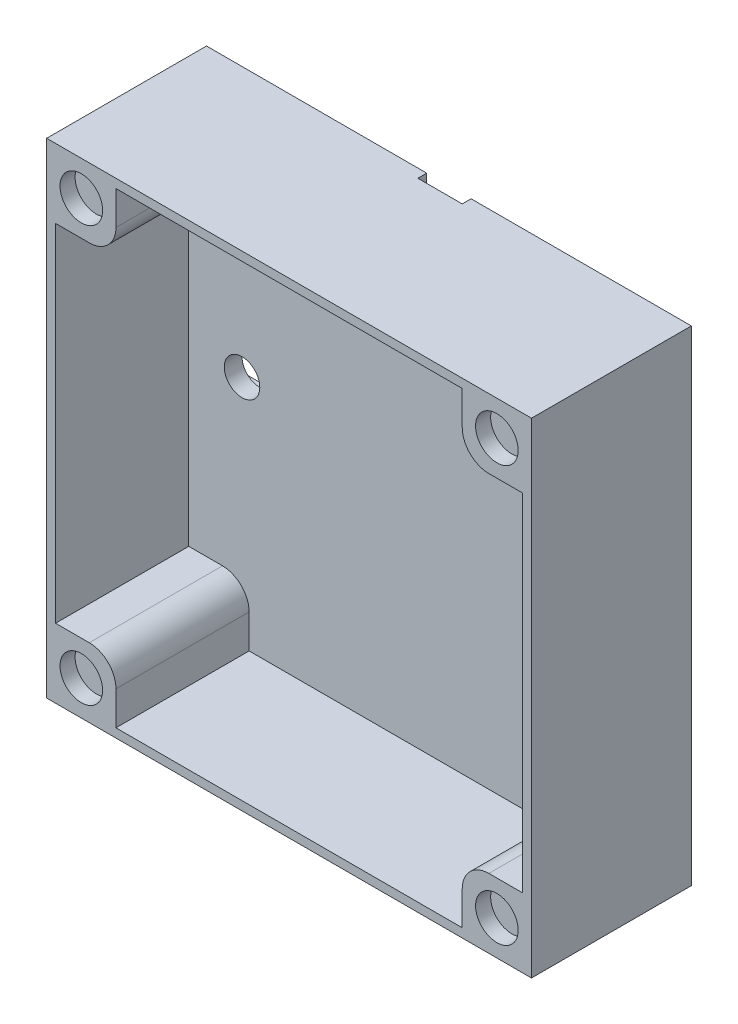
ISO-10303-21;
HEADER;
FILE_DESCRIPTION(('STEP AP214'),'2;1');
FILE_NAME('part.step','',(''),(''),'','','');
FILE_SCHEMA(('AUTOMOTIVE_DESIGN { 1 0 10303 214 1 1 1 1 }'));
ENDSEC;
DATA;
#1=APPLICATION_CONTEXT('core data for automotive mechanical design processes');
#2=APPLICATION_PROTOCOL_DEFINITION('international standard','automotive_design',2000,#1);
#3=PRODUCT_CONTEXT('',#1,'mechanical');
#4=PRODUCT('Part','Part','',(#3));
#5=PRODUCT_RELATED_PRODUCT_CATEGORY('part','',(#4));
#6=PRODUCT_DEFINITION_FORMATION('','',#4);
#7=PRODUCT_DEFINITION_CONTEXT('part definition',#1,'design');
#8=PRODUCT_DEFINITION('design','',#6,#7);
#9=PRODUCT_DEFINITION_SHAPE('','',#8);
#10=(LENGTH_UNIT() NAMED_UNIT(*) SI_UNIT(.MILLI.,.METRE.));
#11=(NAMED_UNIT(*) PLANE_ANGLE_UNIT() SI_UNIT($,.RADIAN.));
#12=(NAMED_UNIT(*) SI_UNIT($,.STERADIAN.) SOLID_ANGLE_UNIT());
#13=UNCERTAINTY_MEASURE_WITH_UNIT(LENGTH_MEASURE(1.E-05),#10,'distance_accuracy_value','');
#14=(GEOMETRIC_REPRESENTATION_CONTEXT(3) GLOBAL_UNCERTAINTY_ASSIGNED_CONTEXT((#13)) GLOBAL_UNIT_ASSIGNED_CONTEXT((#10,
#11,#12)) REPRESENTATION_CONTEXT('',''));
#15=CARTESIAN_POINT('',(0.,0.,0.));
#16=DIRECTION('',(0.,0.,1.));
#17=DIRECTION('',(1.,0.,0.));
#18=AXIS2_PLACEMENT_3D('',#15,#16,#17);
#19=CARTESIAN_POINT('',(0.,0.,0.));
#20=DIRECTION('',(0.,0.,1.));
#21=DIRECTION('',(1.,0.,0.));
#22=AXIS2_PLACEMENT_3D('',#19,#20,#21);
#23=PLANE('',#22);
#24=DIRECTION('',(0.,-1.,0.));
#25=VECTOR('',#24,1.);
#26=CARTESIAN_POINT('',(-2.5,27.3,0.));
#27=LINE('',#26,#25);
#28=CARTESIAN_POINT('',(-2.5,27.3,0.));
#29=VERTEX_POINT('',#28);
#30=CARTESIAN_POINT('',(-2.5,17.5,0.));
#31=VERTEX_POINT('',#30);
#32=EDGE_CURVE('E346',#29,#31,#27,.T.);
#33=ORIENTED_EDGE('',*,*,#32,.T.);
#34=CARTESIAN_POINT('',(-17.5,17.5,0.));
#35=DIRECTION('',(0.,0.,1.));
#36=DIRECTION('',(1.,0.,0.));
#37=AXIS2_PLACEMENT_3D('',#34,#35,#36);
#38=CIRCLE('',#37,15.);
#39=CARTESIAN_POINT('',(-17.5,2.50000000000001,0.));
#40=VERTEX_POINT('',#39);
#41=EDGE_CURVE('E469',#31,#40,#38,.F.);
#42=ORIENTED_EDGE('',*,*,#41,.T.);
#43=DIRECTION('',(-1.,0.,0.));
#44=VECTOR('',#43,1.);
#45=CARTESIAN_POINT('',(2.5,2.50000000000001,0.));
#46=LINE('',#45,#44);
#47=CARTESIAN_POINT('',(-27.3,2.50000000000001,0.));
#48=VERTEX_POINT('',#47);
#49=EDGE_CURVE('E368',#40,#48,#46,.T.);
#50=ORIENTED_EDGE('',*,*,#49,.T.);
#51=DIRECTION('',(0.,-1.,0.));
#52=VECTOR('',#51,1.);
#53=CARTESIAN_POINT('',(-27.3,27.3,0.));
#54=LINE('',#53,#52);
#55=CARTESIAN_POINT('',(-27.3,27.3,0.));
#56=VERTEX_POINT('',#55);
#57=EDGE_CURVE('E395',#56,#48,#54,.T.);
#58=ORIENTED_EDGE('',*,*,#57,.F.);
#59=DIRECTION('',(-1.,0.,0.));
#60=VECTOR('',#59,1.);
#61=CARTESIAN_POINT('',(27.3,27.3,0.));
#62=LINE('',#61,#60);
#63=EDGE_CURVE('E398',#29,#56,#62,.T.);
#64=ORIENTED_EDGE('',*,*,#63,.F.);
#65=EDGE_LOOP('',(#33,#42,#50,#58,#64));
#66=FACE_BOUND('',#65,.T.);
#67=ADVANCED_FACE('F71',(#66),#23,.F.);
#68=CARTESIAN_POINT('',(27.3,-27.3,3.));
#69=DIRECTION('',(0.,-1.,0.));
#70=DIRECTION('',(1.,0.,0.));
#71=AXIS2_PLACEMENT_3D('',#68,#69,#70);
#72=PLANE('',#71);
#73=DIRECTION('',(0.,0.,-1.));
#74=VECTOR('',#73,1.);
#75=CARTESIAN_POINT('',(27.3,-27.3,3.));
#76=LINE('',#75,#74);
#77=CARTESIAN_POINT('',(27.3,-27.3,18.));
#78=VERTEX_POINT('',#77);
#79=CARTESIAN_POINT('',(27.3,-27.3,0.));
#80=VERTEX_POINT('',#79);
#81=EDGE_CURVE('E404',#78,#80,#76,.T.);
#82=ORIENTED_EDGE('',*,*,#81,.F.);
#83=DIRECTION('',(1.,0.,0.));
#84=VECTOR('',#83,1.);
#85=CARTESIAN_POINT('',(0.,-27.3,18.));
#86=LINE('',#85,#84);
#87=CARTESIAN_POINT('',(-27.3,-27.3,18.));
#88=VERTEX_POINT('',#87);
#89=EDGE_CURVE('E337',#88,#78,#86,.T.);
#90=ORIENTED_EDGE('',*,*,#89,.F.);
#91=DIRECTION('',(0.,0.,-1.));
#92=VECTOR('',#91,1.);
#93=CARTESIAN_POINT('',(-27.3,-27.3,3.));
#94=LINE('',#93,#92);
#95=CARTESIAN_POINT('',(-27.3,-27.3,0.));
#96=VERTEX_POINT('',#95);
#97=EDGE_CURVE('E403',#88,#96,#94,.T.);
#98=ORIENTED_EDGE('',*,*,#97,.T.);
#99=DIRECTION('',(-1.,0.,0.));
#100=VECTOR('',#99,1.);
#101=CARTESIAN_POINT('',(27.3,-27.3,0.));
#102=LINE('',#101,#100);
#103=EDGE_CURVE('E379',#80,#96,#102,.T.);
#104=ORIENTED_EDGE('',*,*,#103,.F.);
#105=EDGE_LOOP('',(#82,#90,#98,#104));
#106=FACE_BOUND('',#105,.T.);
#107=ADVANCED_FACE('F496',(#106),#72,.T.);
#108=CARTESIAN_POINT('',(27.3,27.3,3.));
#109=DIRECTION('',(1.,0.,0.));
#110=DIRECTION('',(0.,1.,0.));
#111=AXIS2_PLACEMENT_3D('',#108,#109,#110);
#112=PLANE('',#111);
#113=DIRECTION('',(0.,0.,-1.));
#114=VECTOR('',#113,1.);
#115=CARTESIAN_POINT('',(27.3,27.3,3.));
#116=LINE('',#115,#114);
#117=CARTESIAN_POINT('',(27.3,27.3,18.));
#118=VERTEX_POINT('',#117);
#119=CARTESIAN_POINT('',(27.3,27.3,0.));
#120=VERTEX_POINT('',#119);
#121=EDGE_CURVE('E408',#118,#120,#116,.T.);
#122=ORIENTED_EDGE('',*,*,#121,.F.);
#123=DIRECTION('',(0.,1.,0.));
#124=VECTOR('',#123,1.);
#125=CARTESIAN_POINT('',(27.3,0.,18.));
#126=LINE('',#125,#124);
#127=EDGE_CURVE('E339',#78,#118,#126,.T.);
#128=ORIENTED_EDGE('',*,*,#127,.F.);
#129=ORIENTED_EDGE('',*,*,#81,.T.);
#130=DIRECTION('',(0.,-1.,0.));
#131=VECTOR('',#130,1.);
#132=CARTESIAN_POINT('',(27.3,27.3,0.));
#133=LINE('',#132,#131);
#134=EDGE_CURVE('E401',#120,#80,#133,.T.);
#135=ORIENTED_EDGE('',*,*,#134,.F.);
#136=EDGE_LOOP('',(#122,#128,#129,#135));
#137=FACE_BOUND('',#136,.T.);
#138=ADVANCED_FACE('F503',(#137),#112,.T.);
#139=CARTESIAN_POINT('',(27.3,27.3,3.));
#140=DIRECTION('',(0.,-1.,0.));
#141=DIRECTION('',(1.,0.,0.));
#142=AXIS2_PLACEMENT_3D('',#139,#140,#141);
#143=PLANE('',#142);
#144=ORIENTED_EDGE('',*,*,#63,.T.);
#145=DIRECTION('',(0.,0.,-1.));
#146=VECTOR('',#145,1.);
#147=CARTESIAN_POINT('',(-27.3,27.3,3.));
#148=LINE('',#147,#146);
#149=CARTESIAN_POINT('',(-27.3,27.3,18.));
#150=VERTEX_POINT('',#149);
#151=EDGE_CURVE('E410',#150,#56,#148,.T.);
#152=ORIENTED_EDGE('',*,*,#151,.F.);
#153=DIRECTION('',(-1.,0.,0.));
#154=VECTOR('',#153,1.);
#155=CARTESIAN_POINT('',(0.,27.3,18.));
#156=LINE('',#155,#154);
#157=EDGE_CURVE('E341',#118,#150,#156,.T.);
#158=ORIENTED_EDGE('',*,*,#157,.F.);
#159=ORIENTED_EDGE('',*,*,#121,.T.);
#160=CARTESIAN_POINT('',(2.5,27.3,0.));
#161=VERTEX_POINT('',#160);
#162=EDGE_CURVE('E399',#120,#161,#62,.T.);
#163=ORIENTED_EDGE('',*,*,#162,.T.);
#164=DIRECTION('',(0.,0.,-1.));
#165=VECTOR('',#164,1.);
#166=CARTESIAN_POINT('',(2.5,27.3,1.));
#167=LINE('',#166,#165);
#168=CARTESIAN_POINT('',(2.5,27.3,1.));
#169=VERTEX_POINT('',#168);
#170=EDGE_CURVE('E371',#169,#161,#167,.T.);
#171=ORIENTED_EDGE('',*,*,#170,.F.);
#172=DIRECTION('',(1.,0.,0.));
#173=VECTOR('',#172,1.);
#174=CARTESIAN_POINT('',(-2.5,27.3,1.));
#175=LINE('',#174,#173);
#176=CARTESIAN_POINT('',(-2.5,27.3,1.));
#177=VERTEX_POINT('',#176);
#178=EDGE_CURVE('E380',#177,#169,#175,.T.);
#179=ORIENTED_EDGE('',*,*,#178,.F.);
#180=DIRECTION('',(0.,0.,-1.));
#181=VECTOR('',#180,1.);
#182=CARTESIAN_POINT('',(-2.5,27.3,1.));
#183=LINE('',#182,#181);
#184=EDGE_CURVE('E386',#177,#29,#183,.T.);
#185=ORIENTED_EDGE('',*,*,#184,.T.);
#186=EDGE_LOOP('',(#144,#152,#158,#159,#163,#171,#179,#185));
#187=FACE_BOUND('',#186,.T.);
#188=ADVANCED_FACE('F515',(#187),#143,.F.);
#189=CARTESIAN_POINT('',(-27.3,27.3,3.));
#190=DIRECTION('',(1.,0.,0.));
#191=DIRECTION('',(0.,1.,0.));
#192=AXIS2_PLACEMENT_3D('',#189,#190,#191);
#193=PLANE('',#192);
#194=CARTESIAN_POINT('',(-27.3,-2.49999999999999,0.));
#195=VERTEX_POINT('',#194);
#196=EDGE_CURVE('E394',#195,#96,#54,.T.);
#197=ORIENTED_EDGE('',*,*,#196,.T.);
#198=ORIENTED_EDGE('',*,*,#97,.F.);
#199=DIRECTION('',(0.,-1.,0.));
#200=VECTOR('',#199,1.);
#201=CARTESIAN_POINT('',(-27.3,0.,18.));
#202=LINE('',#201,#200);
#203=EDGE_CURVE('E343',#150,#88,#202,.T.);
#204=ORIENTED_EDGE('',*,*,#203,.F.);
#205=ORIENTED_EDGE('',*,*,#151,.T.);
#206=ORIENTED_EDGE('',*,*,#57,.T.);
#207=DIRECTION('',(0.,0.,-1.));
#208=VECTOR('',#207,1.);
#209=CARTESIAN_POINT('',(-27.3,2.50000000000001,1.));
#210=LINE('',#209,#208);
#211=CARTESIAN_POINT('',(-27.3,2.50000000000001,1.));
#212=VERTEX_POINT('',#211);
#213=EDGE_CURVE('E376',#212,#48,#210,.T.);
#214=ORIENTED_EDGE('',*,*,#213,.F.);
#215=DIRECTION('',(0.,-1.,0.));
#216=VECTOR('',#215,1.);
#217=CARTESIAN_POINT('',(-27.3,2.50000000000001,1.));
#218=LINE('',#217,#216);
#219=CARTESIAN_POINT('',(-27.3,-2.49999999999999,1.));
#220=VERTEX_POINT('',#219);
#221=EDGE_CURVE('E359',#212,#220,#218,.T.);
#222=ORIENTED_EDGE('',*,*,#221,.T.);
#223=DIRECTION('',(0.,0.,-1.));
#224=VECTOR('',#223,1.);
#225=CARTESIAN_POINT('',(-27.3,-2.49999999999999,1.));
#226=LINE('',#225,#224);
#227=EDGE_CURVE('E367',#220,#195,#226,.T.);
#228=ORIENTED_EDGE('',*,*,#227,.T.);
#229=EDGE_LOOP('',(#197,#198,#204,#205,#206,#214,#222,#228));
#230=FACE_BOUND('',#229,.T.);
#231=ADVANCED_FACE('F509',(#230),#193,.F.);
#232=ORIENTED_EDGE('',*,*,#103,.T.);
#233=ORIENTED_EDGE('',*,*,#196,.F.);
#234=DIRECTION('',(-1.,0.,0.));
#235=VECTOR('',#234,1.);
#236=CARTESIAN_POINT('',(2.5,-2.49999999999999,0.));
#237=LINE('',#236,#235);
#238=CARTESIAN_POINT('',(-17.5,-2.49999999999999,0.));
#239=VERTEX_POINT('',#238);
#240=EDGE_CURVE('E370',#239,#195,#237,.T.);
#241=ORIENTED_EDGE('',*,*,#240,.F.);
#242=CARTESIAN_POINT('',(-17.5,17.5,0.));
#243=DIRECTION('',(0.,0.,1.));
#244=DIRECTION('',(1.,0.,0.));
#245=AXIS2_PLACEMENT_3D('',#242,#243,#244);
#246=CIRCLE('',#245,20.);
#247=CARTESIAN_POINT('',(2.5,17.5,0.));
#248=VERTEX_POINT('',#247);
#249=EDGE_CURVE('E12',#239,#248,#246,.T.);
#250=ORIENTED_EDGE('',*,*,#249,.T.);
#251=DIRECTION('',(0.,-1.,0.));
#252=VECTOR('',#251,1.);
#253=CARTESIAN_POINT('',(2.5,2.50000000000001,0.));
#254=LINE('',#253,#252);
#255=EDGE_CURVE('E360',#161,#248,#254,.T.);
#256=ORIENTED_EDGE('',*,*,#255,.F.);
#257=ORIENTED_EDGE('',*,*,#162,.F.);
#258=ORIENTED_EDGE('',*,*,#134,.T.);
#259=EDGE_LOOP('',(#232,#233,#241,#250,#256,#257,#258));
#260=FACE_BOUND('',#259,.T.);
#261=ADVANCED_FACE('F499',(#260),#23,.F.);
#262=CARTESIAN_POINT('',(2.5,-2.49999999999999,1.));
#263=DIRECTION('',(0.,-1.,0.));
#264=DIRECTION('',(0.,0.,-1.));
#265=AXIS2_PLACEMENT_3D('',#262,#263,#264);
#266=PLANE('',#265);
#267=DIRECTION('',(-1.,0.,0.));
#268=VECTOR('',#267,1.);
#269=CARTESIAN_POINT('',(2.5,-2.49999999999999,1.));
#270=LINE('',#269,#268);
#271=CARTESIAN_POINT('',(-17.5,-2.49999999999999,1.));
#272=VERTEX_POINT('',#271);
#273=EDGE_CURVE('E363',#272,#220,#270,.T.);
#274=ORIENTED_EDGE('',*,*,#273,.F.);
#275=DIRECTION('',(0.,0.,-1.));
#276=VECTOR('',#275,1.);
#277=CARTESIAN_POINT('',(-17.5,-2.49999999999999,0.));
#278=LINE('',#277,#276);
#279=EDGE_CURVE('E475',#272,#239,#278,.T.);
#280=ORIENTED_EDGE('',*,*,#279,.T.);
#281=ORIENTED_EDGE('',*,*,#240,.T.);
#282=ORIENTED_EDGE('',*,*,#227,.F.);
#283=EDGE_LOOP('',(#274,#280,#281,#282));
#284=FACE_BOUND('',#283,.T.);
#285=ADVANCED_FACE('F487',(#284),#266,.F.);
#286=CARTESIAN_POINT('',(0.,0.,1.));
#287=DIRECTION('',(0.,0.,1.));
#288=DIRECTION('',(1.,0.,0.));
#289=AXIS2_PLACEMENT_3D('',#286,#287,#288);
#290=PLANE('',#289);
#291=CARTESIAN_POINT('',(0.,20.3,1.));
#292=DIRECTION('',(0.,0.,-1.));
#293=DIRECTION('',(-1.,0.,0.));
#294=AXIS2_PLACEMENT_3D('',#291,#292,#293);
#295=CIRCLE('',#294,2.);
#296=CARTESIAN_POINT('',(-2.,20.3,1.));
#297=VERTEX_POINT('',#296);
#298=EDGE_CURVE('E326',#297,#297,#295,.T.);
#299=ORIENTED_EDGE('',*,*,#298,.F.);
#300=EDGE_LOOP('',(#299));
#301=FACE_BOUND('',#300,.T.);
#302=CARTESIAN_POINT('',(-20.3,0.,1.));
#303=DIRECTION('',(0.,0.,-1.));
#304=DIRECTION('',(-1.,0.,0.));
#305=AXIS2_PLACEMENT_3D('',#302,#303,#304);
#306=CIRCLE('',#305,2.);
#307=CARTESIAN_POINT('',(-22.3,0.,1.));
#308=VERTEX_POINT('',#307);
#309=EDGE_CURVE('E325',#308,#308,#306,.T.);
#310=ORIENTED_EDGE('',*,*,#309,.F.);
#311=EDGE_LOOP('',(#310));
#312=FACE_BOUND('',#311,.T.);
#313=DIRECTION('',(0.,-1.,0.));
#314=VECTOR('',#313,1.);
#315=CARTESIAN_POINT('',(2.5,2.50000000000001,1.));
#316=LINE('',#315,#314);
#317=CARTESIAN_POINT('',(2.5,17.5,1.));
#318=VERTEX_POINT('',#317);
#319=EDGE_CURVE('E365',#169,#318,#316,.T.);
#320=ORIENTED_EDGE('',*,*,#319,.T.);
#321=CARTESIAN_POINT('',(-17.5,17.5,1.));
#322=DIRECTION('',(0.,0.,1.));
#323=DIRECTION('',(1.,0.,0.));
#324=AXIS2_PLACEMENT_3D('',#321,#322,#323);
#325=CIRCLE('',#324,20.);
#326=EDGE_CURVE('E79',#318,#272,#325,.F.);
#327=ORIENTED_EDGE('',*,*,#326,.T.);
#328=ORIENTED_EDGE('',*,*,#273,.T.);
#329=ORIENTED_EDGE('',*,*,#221,.F.);
#330=DIRECTION('',(-1.,0.,0.));
#331=VECTOR('',#330,1.);
#332=CARTESIAN_POINT('',(2.5,2.50000000000001,1.));
#333=LINE('',#332,#331);
#334=CARTESIAN_POINT('',(-17.5,2.50000000000001,1.));
#335=VERTEX_POINT('',#334);
#336=EDGE_CURVE('E357',#335,#212,#333,.T.);
#337=ORIENTED_EDGE('',*,*,#336,.F.);
#338=CARTESIAN_POINT('',(-17.5,17.5,1.));
#339=DIRECTION('',(0.,0.,1.));
#340=DIRECTION('',(1.,0.,0.));
#341=AXIS2_PLACEMENT_3D('',#338,#339,#340);
#342=CIRCLE('',#341,15.);
#343=CARTESIAN_POINT('',(-2.5,17.5,1.));
#344=VERTEX_POINT('',#343);
#345=EDGE_CURVE('E473',#335,#344,#342,.T.);
#346=ORIENTED_EDGE('',*,*,#345,.T.);
#347=DIRECTION('',(0.,-1.,0.));
#348=VECTOR('',#347,1.);
#349=CARTESIAN_POINT('',(-2.5,27.3,1.));
#350=LINE('',#349,#348);
#351=EDGE_CURVE('E383',#177,#344,#350,.T.);
#352=ORIENTED_EDGE('',*,*,#351,.F.);
#353=ORIENTED_EDGE('',*,*,#178,.T.);
#354=EDGE_LOOP('',(#320,#327,#328,#329,#337,#346,#352,#353));
#355=FACE_BOUND('',#354,.T.);
#356=ADVANCED_FACE('F481',(#301,#312,#355),#290,.F.);
#357=CARTESIAN_POINT('',(2.5,2.50000000000001,1.));
#358=DIRECTION('',(0.,-1.,0.));
#359=DIRECTION('',(0.,0.,-1.));
#360=AXIS2_PLACEMENT_3D('',#357,#358,#359);
#361=PLANE('',#360);
#362=ORIENTED_EDGE('',*,*,#49,.F.);
#363=DIRECTION('',(0.,0.,-1.));
#364=VECTOR('',#363,1.);
#365=CARTESIAN_POINT('',(-17.5,2.50000000000001,1.));
#366=LINE('',#365,#364);
#367=EDGE_CURVE('E471',#40,#335,#366,.F.);
#368=ORIENTED_EDGE('',*,*,#367,.T.);
#369=ORIENTED_EDGE('',*,*,#336,.T.);
#370=ORIENTED_EDGE('',*,*,#213,.T.);
#371=EDGE_LOOP('',(#362,#368,#369,#370));
#372=FACE_BOUND('',#371,.T.);
#373=ADVANCED_FACE('F540',(#372),#361,.T.);
#374=CARTESIAN_POINT('',(2.5,2.50000000000001,1.));
#375=DIRECTION('',(1.,0.,0.));
#376=DIRECTION('',(0.,0.,-1.));
#377=AXIS2_PLACEMENT_3D('',#374,#375,#376);
#378=PLANE('',#377);
#379=ORIENTED_EDGE('',*,*,#255,.T.);
#380=DIRECTION('',(0.,0.,-1.));
#381=VECTOR('',#380,1.);
#382=CARTESIAN_POINT('',(2.5,17.5,1.));
#383=LINE('',#382,#381);
#384=EDGE_CURVE('E86',#248,#318,#383,.F.);
#385=ORIENTED_EDGE('',*,*,#384,.T.);
#386=ORIENTED_EDGE('',*,*,#319,.F.);
#387=ORIENTED_EDGE('',*,*,#170,.T.);
#388=EDGE_LOOP('',(#379,#385,#386,#387));
#389=FACE_BOUND('',#388,.T.);
#390=ADVANCED_FACE('F549',(#389),#378,.F.);
#391=CARTESIAN_POINT('',(-2.5,27.3,1.));
#392=DIRECTION('',(1.,0.,0.));
#393=DIRECTION('',(0.,1.,0.));
#394=AXIS2_PLACEMENT_3D('',#391,#392,#393);
#395=PLANE('',#394);
#396=ORIENTED_EDGE('',*,*,#351,.T.);
#397=DIRECTION('',(0.,0.,-1.));
#398=VECTOR('',#397,1.);
#399=CARTESIAN_POINT('',(-2.5,17.5,1.));
#400=LINE('',#399,#398);
#401=EDGE_CURVE('E466',#344,#31,#400,.T.);
#402=ORIENTED_EDGE('',*,*,#401,.T.);
#403=ORIENTED_EDGE('',*,*,#32,.F.);
#404=ORIENTED_EDGE('',*,*,#184,.F.);
#405=EDGE_LOOP('',(#396,#402,#403,#404));
#406=FACE_BOUND('',#405,.T.);
#407=ADVANCED_FACE('F547',(#406),#395,.T.);
#408=CARTESIAN_POINT('',(26.3,0.,18.));
#409=DIRECTION('',(1.,0.,0.));
#410=DIRECTION('',(0.,1.,0.));
#411=AXIS2_PLACEMENT_3D('',#408,#409,#410);
#412=PLANE('',#411);
#413=DIRECTION('',(0.,-1.,0.));
#414=VECTOR('',#413,1.);
#415=CARTESIAN_POINT('',(26.3,0.,3.));
#416=LINE('',#415,#414);
#417=CARTESIAN_POINT('',(26.3,19.5,3.));
#418=VERTEX_POINT('',#417);
#419=CARTESIAN_POINT('',(26.3,-19.5,3.));
#420=VERTEX_POINT('',#419);
#421=EDGE_CURVE('E279',#418,#420,#416,.T.);
#422=ORIENTED_EDGE('',*,*,#421,.T.);
#423=DIRECTION('',(0.,0.,1.));
#424=VECTOR('',#423,1.);
#425=CARTESIAN_POINT('',(26.3,-19.5,18.));
#426=LINE('',#425,#424);
#427=CARTESIAN_POINT('',(26.3,-19.5,18.));
#428=VERTEX_POINT('',#427);
#429=EDGE_CURVE('E301',#420,#428,#426,.T.);
#430=ORIENTED_EDGE('',*,*,#429,.T.);
#431=DIRECTION('',(0.,-1.,0.));
#432=VECTOR('',#431,1.);
#433=CARTESIAN_POINT('',(26.3,0.,18.));
#434=LINE('',#433,#432);
#435=CARTESIAN_POINT('',(26.3,19.5,18.));
#436=VERTEX_POINT('',#435);
#437=EDGE_CURVE('E334',#436,#428,#434,.T.);
#438=ORIENTED_EDGE('',*,*,#437,.F.);
#439=DIRECTION('',(0.,0.,-1.));
#440=VECTOR('',#439,1.);
#441=CARTESIAN_POINT('',(26.3,19.5,18.));
#442=LINE('',#441,#440);
#443=EDGE_CURVE('E319',#436,#418,#442,.T.);
#444=ORIENTED_EDGE('',*,*,#443,.T.);
#445=EDGE_LOOP('',(#422,#430,#438,#444));
#446=FACE_BOUND('',#445,.T.);
#447=ADVANCED_FACE('F602',(#446),#412,.F.);
#448=CARTESIAN_POINT('',(-26.3,0.,18.));
#449=DIRECTION('',(1.,0.,0.));
#450=DIRECTION('',(0.,1.,0.));
#451=AXIS2_PLACEMENT_3D('',#448,#449,#450);
#452=PLANE('',#451);
#453=DIRECTION('',(0.,0.,1.));
#454=VECTOR('',#453,1.);
#455=CARTESIAN_POINT('',(-26.3,-19.5,18.));
#456=LINE('',#455,#454);
#457=CARTESIAN_POINT('',(-26.3,-19.5,3.));
#458=VERTEX_POINT('',#457);
#459=CARTESIAN_POINT('',(-26.3,-19.5,18.));
#460=VERTEX_POINT('',#459);
#461=EDGE_CURVE('E261',#458,#460,#456,.T.);
#462=ORIENTED_EDGE('',*,*,#461,.F.);
#463=DIRECTION('',(0.,-1.,0.));
#464=VECTOR('',#463,1.);
#465=CARTESIAN_POINT('',(-26.3,0.,3.));
#466=LINE('',#465,#464);
#467=CARTESIAN_POINT('',(-26.3,19.5,3.));
#468=VERTEX_POINT('',#467);
#469=EDGE_CURVE('E270',#468,#458,#466,.T.);
#470=ORIENTED_EDGE('',*,*,#469,.F.);
#471=DIRECTION('',(0.,0.,-1.));
#472=VECTOR('',#471,1.);
#473=CARTESIAN_POINT('',(-26.3,19.5,18.));
#474=LINE('',#473,#472);
#475=CARTESIAN_POINT('',(-26.3,19.5,18.));
#476=VERTEX_POINT('',#475);
#477=EDGE_CURVE('E312',#476,#468,#474,.T.);
#478=ORIENTED_EDGE('',*,*,#477,.F.);
#479=DIRECTION('',(0.,-1.,0.));
#480=VECTOR('',#479,1.);
#481=CARTESIAN_POINT('',(-26.3,0.,18.));
#482=LINE('',#481,#480);
#483=EDGE_CURVE('E283',#476,#460,#482,.T.);
#484=ORIENTED_EDGE('',*,*,#483,.T.);
#485=EDGE_LOOP('',(#462,#470,#478,#484));
#486=FACE_BOUND('',#485,.T.);
#487=ADVANCED_FACE('F281',(#486),#452,.T.);
#488=CARTESIAN_POINT('',(0.,26.3,18.));
#489=DIRECTION('',(0.,1.,0.));
#490=DIRECTION('',(0.,0.,1.));
#491=AXIS2_PLACEMENT_3D('',#488,#489,#490);
#492=PLANE('',#491);
#493=DIRECTION('',(1.,0.,0.));
#494=VECTOR('',#493,1.);
#495=CARTESIAN_POINT('',(0.,26.3,18.));
#496=LINE('',#495,#494);
#497=CARTESIAN_POINT('',(-19.5,26.3,18.));
#498=VERTEX_POINT('',#497);
#499=CARTESIAN_POINT('',(19.5,26.3,18.));
#500=VERTEX_POINT('',#499);
#501=EDGE_CURVE('E278',#498,#500,#496,.T.);
#502=ORIENTED_EDGE('',*,*,#501,.F.);
#503=DIRECTION('',(0.,0.,-1.));
#504=VECTOR('',#503,1.);
#505=CARTESIAN_POINT('',(-19.5,26.3,18.));
#506=LINE('',#505,#504);
#507=CARTESIAN_POINT('',(-19.5,26.3,3.));
#508=VERTEX_POINT('',#507);
#509=EDGE_CURVE('E309',#498,#508,#506,.T.);
#510=ORIENTED_EDGE('',*,*,#509,.T.);
#511=DIRECTION('',(1.,0.,0.));
#512=VECTOR('',#511,1.);
#513=CARTESIAN_POINT('',(0.,26.3,3.));
#514=LINE('',#513,#512);
#515=CARTESIAN_POINT('',(19.5,26.3,3.));
#516=VERTEX_POINT('',#515);
#517=EDGE_CURVE('E347',#508,#516,#514,.T.);
#518=ORIENTED_EDGE('',*,*,#517,.T.);
#519=DIRECTION('',(0.,0.,1.));
#520=VECTOR('',#519,1.);
#521=CARTESIAN_POINT('',(19.5,26.3,18.));
#522=LINE('',#521,#520);
#523=EDGE_CURVE('E322',#516,#500,#522,.T.);
#524=ORIENTED_EDGE('',*,*,#523,.T.);
#525=EDGE_LOOP('',(#502,#510,#518,#524));
#526=FACE_BOUND('',#525,.T.);
#527=ADVANCED_FACE('F587',(#526),#492,.F.);
#528=CARTESIAN_POINT('',(0.,0.,18.));
#529=DIRECTION('',(0.,0.,1.));
#530=DIRECTION('',(1.,0.,0.));
#531=AXIS2_PLACEMENT_3D('',#528,#529,#530);
#532=PLANE('',#531);
#533=CARTESIAN_POINT('',(23.4002805646626,-23.4,18.));
#534=DIRECTION('',(0.,0.,1.));
#535=DIRECTION('',(1.,0.,0.));
#536=AXIS2_PLACEMENT_3D('',#533,#534,#535);
#537=CIRCLE('',#536,2.4);
#538=CARTESIAN_POINT('',(25.8002805646626,-23.4,18.));
#539=VERTEX_POINT('',#538);
#540=EDGE_CURVE('E996',#539,#539,#537,.T.);
#541=ORIENTED_EDGE('',*,*,#540,.F.);
#542=EDGE_LOOP('',(#541));
#543=FACE_BOUND('',#542,.T.);
#544=CARTESIAN_POINT('',(23.4002805646626,23.4,18.));
#545=DIRECTION('',(0.,0.,1.));
#546=DIRECTION('',(1.,0.,0.));
#547=AXIS2_PLACEMENT_3D('',#544,#545,#546);
#548=CIRCLE('',#547,2.4);
#549=CARTESIAN_POINT('',(25.8002805646626,23.4,18.));
#550=VERTEX_POINT('',#549);
#551=EDGE_CURVE('E995',#550,#550,#548,.T.);
#552=ORIENTED_EDGE('',*,*,#551,.F.);
#553=EDGE_LOOP('',(#552));
#554=FACE_BOUND('',#553,.T.);
#555=CARTESIAN_POINT('',(-23.4,23.4,18.));
#556=DIRECTION('',(0.,0.,1.));
#557=DIRECTION('',(1.,0.,0.));
#558=AXIS2_PLACEMENT_3D('',#555,#556,#557);
#559=CIRCLE('',#558,2.4);
#560=CARTESIAN_POINT('',(-21.,23.4,18.));
#561=VERTEX_POINT('',#560);
#562=EDGE_CURVE('E1014',#561,#561,#559,.T.);
#563=ORIENTED_EDGE('',*,*,#562,.F.);
#564=EDGE_LOOP('',(#563));
#565=FACE_BOUND('',#564,.T.);
#566=CARTESIAN_POINT('',(-23.4,-23.4,18.));
#567=DIRECTION('',(0.,0.,1.));
#568=DIRECTION('',(1.,0.,0.));
#569=AXIS2_PLACEMENT_3D('',#566,#567,#568);
#570=CIRCLE('',#569,2.4);
#571=CARTESIAN_POINT('',(-21.,-23.4,18.));
#572=VERTEX_POINT('',#571);
#573=EDGE_CURVE('E1008',#572,#572,#570,.T.);
#574=ORIENTED_EDGE('',*,*,#573,.F.);
#575=EDGE_LOOP('',(#574));
#576=FACE_BOUND('',#575,.T.);
#577=DIRECTION('',(0.,1.,0.));
#578=VECTOR('',#577,1.);
#579=CARTESIAN_POINT('',(19.5,27.3,18.));
#580=LINE('',#579,#578);
#581=CARTESIAN_POINT('',(19.5,22.5,18.));
#582=VERTEX_POINT('',#581);
#583=EDGE_CURVE('E317',#582,#500,#580,.T.);
#584=ORIENTED_EDGE('',*,*,#583,.F.);
#585=CARTESIAN_POINT('',(22.5,22.5,18.));
#586=DIRECTION('',(0.,0.,1.));
#587=DIRECTION('',(1.,0.,0.));
#588=AXIS2_PLACEMENT_3D('',#585,#586,#587);
#589=CIRCLE('',#588,3.);
#590=CARTESIAN_POINT('',(22.5,19.5,18.));
#591=VERTEX_POINT('',#590);
#592=EDGE_CURVE('E443',#582,#591,#589,.T.);
#593=ORIENTED_EDGE('',*,*,#592,.T.);
#594=DIRECTION('',(-1.,0.,0.));
#595=VECTOR('',#594,1.);
#596=CARTESIAN_POINT('',(27.3,19.5,18.));
#597=LINE('',#596,#595);
#598=EDGE_CURVE('E314',#436,#591,#597,.T.);
#599=ORIENTED_EDGE('',*,*,#598,.F.);
#600=ORIENTED_EDGE('',*,*,#437,.T.);
#601=DIRECTION('',(1.,0.,0.));
#602=VECTOR('',#601,1.);
#603=CARTESIAN_POINT('',(27.3,-19.5,18.));
#604=LINE('',#603,#602);
#605=CARTESIAN_POINT('',(22.5,-19.5,18.));
#606=VERTEX_POINT('',#605);
#607=EDGE_CURVE('E296',#606,#428,#604,.T.);
#608=ORIENTED_EDGE('',*,*,#607,.F.);
#609=CARTESIAN_POINT('',(22.5,-22.5,18.));
#610=DIRECTION('',(0.,0.,1.));
#611=DIRECTION('',(1.,0.,0.));
#612=AXIS2_PLACEMENT_3D('',#609,#610,#611);
#613=CIRCLE('',#612,3.);
#614=CARTESIAN_POINT('',(19.5,-22.5,18.));
#615=VERTEX_POINT('',#614);
#616=EDGE_CURVE('E441',#606,#615,#613,.T.);
#617=ORIENTED_EDGE('',*,*,#616,.T.);
#618=DIRECTION('',(0.,1.,0.));
#619=VECTOR('',#618,1.);
#620=CARTESIAN_POINT('',(19.5,-27.3,18.));
#621=LINE('',#620,#619);
#622=CARTESIAN_POINT('',(19.5,-26.3,18.));
#623=VERTEX_POINT('',#622);
#624=EDGE_CURVE('E288',#623,#615,#621,.T.);
#625=ORIENTED_EDGE('',*,*,#624,.F.);
#626=DIRECTION('',(1.,0.,0.));
#627=VECTOR('',#626,1.);
#628=CARTESIAN_POINT('',(-26.3,-26.3,18.));
#629=LINE('',#628,#627);
#630=CARTESIAN_POINT('',(-19.5,-26.3,18.));
#631=VERTEX_POINT('',#630);
#632=EDGE_CURVE('E349',#631,#623,#629,.T.);
#633=ORIENTED_EDGE('',*,*,#632,.F.);
#634=DIRECTION('',(0.,-1.,0.));
#635=VECTOR('',#634,1.);
#636=CARTESIAN_POINT('',(-19.5,-27.3,18.));
#637=LINE('',#636,#635);
#638=CARTESIAN_POINT('',(-19.5,-22.5,18.));
#639=VERTEX_POINT('',#638);
#640=EDGE_CURVE('E285',#639,#631,#637,.T.);
#641=ORIENTED_EDGE('',*,*,#640,.F.);
#642=CARTESIAN_POINT('',(-22.5,-22.5,18.));
#643=DIRECTION('',(0.,0.,1.));
#644=DIRECTION('',(1.,0.,0.));
#645=AXIS2_PLACEMENT_3D('',#642,#643,#644);
#646=CIRCLE('',#645,3.);
#647=CARTESIAN_POINT('',(-22.5,-19.5,18.));
#648=VERTEX_POINT('',#647);
#649=EDGE_CURVE('E439',#639,#648,#646,.T.);
#650=ORIENTED_EDGE('',*,*,#649,.T.);
#651=DIRECTION('',(1.,0.,0.));
#652=VECTOR('',#651,1.);
#653=CARTESIAN_POINT('',(-27.3,-19.5,18.));
#654=LINE('',#653,#652);
#655=EDGE_CURVE('E290',#460,#648,#654,.T.);
#656=ORIENTED_EDGE('',*,*,#655,.F.);
#657=ORIENTED_EDGE('',*,*,#483,.F.);
#658=DIRECTION('',(-1.,0.,0.));
#659=VECTOR('',#658,1.);
#660=CARTESIAN_POINT('',(-27.3,19.5,18.));
#661=LINE('',#660,#659);
#662=CARTESIAN_POINT('',(-22.5,19.5,18.));
#663=VERTEX_POINT('',#662);
#664=EDGE_CURVE('E307',#663,#476,#661,.T.);
#665=ORIENTED_EDGE('',*,*,#664,.F.);
#666=CARTESIAN_POINT('',(-22.5,22.5,18.));
#667=DIRECTION('',(0.,0.,1.));
#668=DIRECTION('',(1.,0.,0.));
#669=AXIS2_PLACEMENT_3D('',#666,#667,#668);
#670=CIRCLE('',#669,3.);
#671=CARTESIAN_POINT('',(-19.5,22.5,18.));
#672=VERTEX_POINT('',#671);
#673=EDGE_CURVE('E437',#663,#672,#670,.T.);
#674=ORIENTED_EDGE('',*,*,#673,.T.);
#675=DIRECTION('',(0.,-1.,0.));
#676=VECTOR('',#675,1.);
#677=CARTESIAN_POINT('',(-19.5,27.3,18.));
#678=LINE('',#677,#676);
#679=EDGE_CURVE('E304',#498,#672,#678,.T.);
#680=ORIENTED_EDGE('',*,*,#679,.F.);
#681=ORIENTED_EDGE('',*,*,#501,.T.);
#682=EDGE_LOOP('',(#584,#593,#599,#600,#608,#617,#625,#633,#641,#650,#656,#657,#665,#674,#680,#681));
#683=FACE_BOUND('',#682,.T.);
#684=ORIENTED_EDGE('',*,*,#89,.T.);
#685=ORIENTED_EDGE('',*,*,#127,.T.);
#686=ORIENTED_EDGE('',*,*,#157,.T.);
#687=ORIENTED_EDGE('',*,*,#203,.T.);
#688=EDGE_LOOP('',(#684,#685,#686,#687));
#689=FACE_BOUND('',#688,.T.);
#690=ADVANCED_FACE('F529',(#543,#554,#565,#576,#683,#689),#532,.T.);
#691=CARTESIAN_POINT('',(-26.3,-26.3,18.));
#692=DIRECTION('',(0.,1.,0.));
#693=DIRECTION('',(0.,0.,1.));
#694=AXIS2_PLACEMENT_3D('',#691,#692,#693);
#695=PLANE('',#694);
#696=DIRECTION('',(0.,0.,-1.));
#697=VECTOR('',#696,1.);
#698=CARTESIAN_POINT('',(-19.5,-26.3,18.));
#699=LINE('',#698,#697);
#700=CARTESIAN_POINT('',(-19.5,-26.3,3.));
#701=VERTEX_POINT('',#700);
#702=EDGE_CURVE('E284',#631,#701,#699,.T.);
#703=ORIENTED_EDGE('',*,*,#702,.F.);
#704=ORIENTED_EDGE('',*,*,#632,.T.);
#705=DIRECTION('',(0.,0.,1.));
#706=VECTOR('',#705,1.);
#707=CARTESIAN_POINT('',(19.5,-26.3,18.));
#708=LINE('',#707,#706);
#709=CARTESIAN_POINT('',(19.5,-26.3,3.));
#710=VERTEX_POINT('',#709);
#711=EDGE_CURVE('E298',#710,#623,#708,.T.);
#712=ORIENTED_EDGE('',*,*,#711,.F.);
#713=DIRECTION('',(1.,0.,0.));
#714=VECTOR('',#713,1.);
#715=CARTESIAN_POINT('',(-26.3,-26.3,3.));
#716=LINE('',#715,#714);
#717=EDGE_CURVE('E353',#701,#710,#716,.T.);
#718=ORIENTED_EDGE('',*,*,#717,.F.);
#719=EDGE_LOOP('',(#703,#704,#712,#718));
#720=FACE_BOUND('',#719,.T.);
#721=ADVANCED_FACE('F616',(#720),#695,.T.);
#722=CARTESIAN_POINT('',(0.,0.,3.));
#723=DIRECTION('',(0.,0.,1.));
#724=DIRECTION('',(1.,0.,0.));
#725=AXIS2_PLACEMENT_3D('',#722,#723,#724);
#726=PLANE('',#725);
#727=DIRECTION('',(0.,1.,0.));
#728=VECTOR('',#727,1.);
#729=CARTESIAN_POINT('',(-19.5,0.,3.));
#730=LINE('',#729,#728);
#731=CARTESIAN_POINT('',(-19.5,-22.5,3.));
#732=VERTEX_POINT('',#731);
#733=EDGE_CURVE('E266',#701,#732,#730,.T.);
#734=ORIENTED_EDGE('',*,*,#733,.F.);
#735=ORIENTED_EDGE('',*,*,#717,.T.);
#736=DIRECTION('',(0.,-1.,0.));
#737=VECTOR('',#736,1.);
#738=CARTESIAN_POINT('',(19.5,0.,3.));
#739=LINE('',#738,#737);
#740=CARTESIAN_POINT('',(19.5,-22.5,3.));
#741=VERTEX_POINT('',#740);
#742=EDGE_CURVE('E426',#741,#710,#739,.T.);
#743=ORIENTED_EDGE('',*,*,#742,.F.);
#744=CARTESIAN_POINT('',(22.5,-22.5,3.));
#745=DIRECTION('',(0.,0.,1.));
#746=DIRECTION('',(1.,0.,0.));
#747=AXIS2_PLACEMENT_3D('',#744,#745,#746);
#748=CIRCLE('',#747,3.);
#749=CARTESIAN_POINT('',(22.5,-19.5,3.));
#750=VERTEX_POINT('',#749);
#751=EDGE_CURVE('E460',#741,#750,#748,.F.);
#752=ORIENTED_EDGE('',*,*,#751,.T.);
#753=DIRECTION('',(-1.,0.,0.));
#754=VECTOR('',#753,1.);
#755=CARTESIAN_POINT('',(0.,-19.5,3.));
#756=LINE('',#755,#754);
#757=EDGE_CURVE('E267',#420,#750,#756,.T.);
#758=ORIENTED_EDGE('',*,*,#757,.F.);
#759=ORIENTED_EDGE('',*,*,#421,.F.);
#760=DIRECTION('',(1.,0.,0.));
#761=VECTOR('',#760,1.);
#762=CARTESIAN_POINT('',(0.,19.5,3.));
#763=LINE('',#762,#761);
#764=CARTESIAN_POINT('',(22.5,19.5,3.));
#765=VERTEX_POINT('',#764);
#766=EDGE_CURVE('E407',#765,#418,#763,.T.);
#767=ORIENTED_EDGE('',*,*,#766,.F.);
#768=CARTESIAN_POINT('',(22.5,22.5,3.));
#769=DIRECTION('',(0.,0.,1.));
#770=DIRECTION('',(1.,0.,0.));
#771=AXIS2_PLACEMENT_3D('',#768,#769,#770);
#772=CIRCLE('',#771,3.);
#773=CARTESIAN_POINT('',(19.5,22.5,3.));
#774=VERTEX_POINT('',#773);
#775=EDGE_CURVE('E458',#765,#774,#772,.F.);
#776=ORIENTED_EDGE('',*,*,#775,.T.);
#777=DIRECTION('',(0.,-1.,0.));
#778=VECTOR('',#777,1.);
#779=CARTESIAN_POINT('',(19.5,0.,3.));
#780=LINE('',#779,#778);
#781=EDGE_CURVE('E420',#516,#774,#780,.T.);
#782=ORIENTED_EDGE('',*,*,#781,.F.);
#783=ORIENTED_EDGE('',*,*,#517,.F.);
#784=DIRECTION('',(0.,1.,0.));
#785=VECTOR('',#784,1.);
#786=CARTESIAN_POINT('',(-19.5,0.,3.));
#787=LINE('',#786,#785);
#788=CARTESIAN_POINT('',(-19.5,22.5,3.));
#789=VERTEX_POINT('',#788);
#790=EDGE_CURVE('E423',#789,#508,#787,.T.);
#791=ORIENTED_EDGE('',*,*,#790,.F.);
#792=CARTESIAN_POINT('',(-22.5,22.5,3.));
#793=DIRECTION('',(0.,0.,1.));
#794=DIRECTION('',(1.,0.,0.));
#795=AXIS2_PLACEMENT_3D('',#792,#793,#794);
#796=CIRCLE('',#795,3.);
#797=CARTESIAN_POINT('',(-22.5,19.5,3.));
#798=VERTEX_POINT('',#797);
#799=EDGE_CURVE('E464',#789,#798,#796,.F.);
#800=ORIENTED_EDGE('',*,*,#799,.T.);
#801=DIRECTION('',(1.,0.,0.));
#802=VECTOR('',#801,1.);
#803=CARTESIAN_POINT('',(0.,19.5,3.));
#804=LINE('',#803,#802);
#805=EDGE_CURVE('E274',#468,#798,#804,.T.);
#806=ORIENTED_EDGE('',*,*,#805,.F.);
#807=ORIENTED_EDGE('',*,*,#469,.T.);
#808=DIRECTION('',(-1.,0.,0.));
#809=VECTOR('',#808,1.);
#810=CARTESIAN_POINT('',(0.,-19.5,3.));
#811=LINE('',#810,#809);
#812=CARTESIAN_POINT('',(-22.5,-19.5,3.));
#813=VERTEX_POINT('',#812);
#814=EDGE_CURVE('E256',#813,#458,#811,.T.);
#815=ORIENTED_EDGE('',*,*,#814,.F.);
#816=CARTESIAN_POINT('',(-22.5,-22.5,3.));
#817=DIRECTION('',(0.,0.,1.));
#818=DIRECTION('',(1.,0.,0.));
#819=AXIS2_PLACEMENT_3D('',#816,#817,#818);
#820=CIRCLE('',#819,3.);
#821=EDGE_CURVE('E462',#813,#732,#820,.F.);
#822=ORIENTED_EDGE('',*,*,#821,.T.);
#823=EDGE_LOOP('',(#734,#735,#743,#752,#758,#759,#767,#776,#782,#783,#791,#800,#806,#807,#815,#822));
#824=FACE_BOUND('',#823,.T.);
#825=CARTESIAN_POINT('',(0.,20.3,3.));
#826=DIRECTION('',(0.,0.,1.));
#827=DIRECTION('',(1.,0.,0.));
#828=AXIS2_PLACEMENT_3D('',#825,#826,#827);
#829=CIRCLE('',#828,2.);
#830=CARTESIAN_POINT('',(2.,20.3,3.));
#831=VERTEX_POINT('',#830);
#832=EDGE_CURVE('E356',#831,#831,#829,.T.);
#833=ORIENTED_EDGE('',*,*,#832,.F.);
#834=EDGE_LOOP('',(#833));
#835=FACE_BOUND('',#834,.T.);
#836=CARTESIAN_POINT('',(-20.3,0.,3.));
#837=DIRECTION('',(0.,0.,1.));
#838=DIRECTION('',(1.,0.,0.));
#839=AXIS2_PLACEMENT_3D('',#836,#837,#838);
#840=CIRCLE('',#839,2.);
#841=CARTESIAN_POINT('',(-18.3,0.,3.));
#842=VERTEX_POINT('',#841);
#843=EDGE_CURVE('E329',#842,#842,#840,.T.);
#844=ORIENTED_EDGE('',*,*,#843,.F.);
#845=EDGE_LOOP('',(#844));
#846=FACE_BOUND('',#845,.T.);
#847=ADVANCED_FACE('F271',(#824,#835,#846),#726,.T.);
#848=CARTESIAN_POINT('',(-20.3,0.,8.));
#849=DIRECTION('',(0.,0.,-1.));
#850=DIRECTION('',(-1.,0.,0.));
#851=AXIS2_PLACEMENT_3D('',#848,#849,#850);
#852=CYLINDRICAL_SURFACE('',#851,2.);
#853=ORIENTED_EDGE('',*,*,#843,.T.);
#854=EDGE_LOOP('',(#853));
#855=FACE_BOUND('',#854,.T.);
#856=ORIENTED_EDGE('',*,*,#309,.T.);
#857=EDGE_LOOP('',(#856));
#858=FACE_BOUND('',#857,.T.);
#859=ADVANCED_FACE('F652',(#855,#858),#852,.F.);
#860=CARTESIAN_POINT('',(0.,20.3,8.));
#861=DIRECTION('',(0.,0.,-1.));
#862=DIRECTION('',(-1.,0.,0.));
#863=AXIS2_PLACEMENT_3D('',#860,#861,#862);
#864=CYLINDRICAL_SURFACE('',#863,2.);
#865=ORIENTED_EDGE('',*,*,#832,.T.);
#866=EDGE_LOOP('',(#865));
#867=FACE_BOUND('',#866,.T.);
#868=ORIENTED_EDGE('',*,*,#298,.T.);
#869=EDGE_LOOP('',(#868));
#870=FACE_BOUND('',#869,.T.);
#871=ADVANCED_FACE('F647',(#867,#870),#864,.F.);
#872=CARTESIAN_POINT('',(19.5,27.3,18.));
#873=DIRECTION('',(-1.,0.,0.));
#874=DIRECTION('',(0.,0.,1.));
#875=AXIS2_PLACEMENT_3D('',#872,#873,#874);
#876=PLANE('',#875);
#877=ORIENTED_EDGE('',*,*,#781,.T.);
#878=DIRECTION('',(0.,0.,-1.));
#879=VECTOR('',#878,1.);
#880=CARTESIAN_POINT('',(19.5,22.5,18.));
#881=LINE('',#880,#879);
#882=EDGE_CURVE('E435',#774,#582,#881,.F.);
#883=ORIENTED_EDGE('',*,*,#882,.T.);
#884=ORIENTED_EDGE('',*,*,#583,.T.);
#885=ORIENTED_EDGE('',*,*,#523,.F.);
#886=EDGE_LOOP('',(#877,#883,#884,#885));
#887=FACE_BOUND('',#886,.T.);
#888=ADVANCED_FACE('F644',(#887),#876,.T.);
#889=CARTESIAN_POINT('',(27.3,19.5,18.));
#890=DIRECTION('',(0.,-1.,0.));
#891=DIRECTION('',(0.,0.,-1.));
#892=AXIS2_PLACEMENT_3D('',#889,#890,#891);
#893=PLANE('',#892);
#894=ORIENTED_EDGE('',*,*,#598,.T.);
#895=DIRECTION('',(0.,0.,-1.));
#896=VECTOR('',#895,1.);
#897=CARTESIAN_POINT('',(22.5,19.5,18.));
#898=LINE('',#897,#896);
#899=EDGE_CURVE('E432',#591,#765,#898,.T.);
#900=ORIENTED_EDGE('',*,*,#899,.T.);
#901=ORIENTED_EDGE('',*,*,#766,.T.);
#902=ORIENTED_EDGE('',*,*,#443,.F.);
#903=EDGE_LOOP('',(#894,#900,#901,#902));
#904=FACE_BOUND('',#903,.T.);
#905=ADVANCED_FACE('F597',(#904),#893,.T.);
#906=CARTESIAN_POINT('',(-19.5,27.3,18.));
#907=DIRECTION('',(1.,0.,0.));
#908=DIRECTION('',(0.,0.,-1.));
#909=AXIS2_PLACEMENT_3D('',#906,#907,#908);
#910=PLANE('',#909);
#911=ORIENTED_EDGE('',*,*,#679,.T.);
#912=DIRECTION('',(0.,0.,-1.));
#913=VECTOR('',#912,1.);
#914=CARTESIAN_POINT('',(-19.5,22.5,18.));
#915=LINE('',#914,#913);
#916=EDGE_CURVE('E453',#672,#789,#915,.T.);
#917=ORIENTED_EDGE('',*,*,#916,.T.);
#918=ORIENTED_EDGE('',*,*,#790,.T.);
#919=ORIENTED_EDGE('',*,*,#509,.F.);
#920=EDGE_LOOP('',(#911,#917,#918,#919));
#921=FACE_BOUND('',#920,.T.);
#922=ADVANCED_FACE('F583',(#921),#910,.T.);
#923=CARTESIAN_POINT('',(-27.3,19.5,18.));
#924=DIRECTION('',(0.,-1.,0.));
#925=DIRECTION('',(0.,0.,-1.));
#926=AXIS2_PLACEMENT_3D('',#923,#924,#925);
#927=PLANE('',#926);
#928=ORIENTED_EDGE('',*,*,#805,.T.);
#929=DIRECTION('',(0.,0.,-1.));
#930=VECTOR('',#929,1.);
#931=CARTESIAN_POINT('',(-22.5,19.5,18.));
#932=LINE('',#931,#930);
#933=EDGE_CURVE('E456',#798,#663,#932,.F.);
#934=ORIENTED_EDGE('',*,*,#933,.T.);
#935=ORIENTED_EDGE('',*,*,#664,.T.);
#936=ORIENTED_EDGE('',*,*,#477,.T.);
#937=EDGE_LOOP('',(#928,#934,#935,#936));
#938=FACE_BOUND('',#937,.T.);
#939=ADVANCED_FACE('F637',(#938),#927,.T.);
#940=CARTESIAN_POINT('',(27.3,-19.5,18.));
#941=DIRECTION('',(0.,1.,0.));
#942=DIRECTION('',(0.,0.,1.));
#943=AXIS2_PLACEMENT_3D('',#940,#941,#942);
#944=PLANE('',#943);
#945=ORIENTED_EDGE('',*,*,#757,.T.);
#946=DIRECTION('',(0.,0.,-1.));
#947=VECTOR('',#946,1.);
#948=CARTESIAN_POINT('',(22.5,-19.5,18.));
#949=LINE('',#948,#947);
#950=EDGE_CURVE('E448',#750,#606,#949,.F.);
#951=ORIENTED_EDGE('',*,*,#950,.T.);
#952=ORIENTED_EDGE('',*,*,#607,.T.);
#953=ORIENTED_EDGE('',*,*,#429,.F.);
#954=EDGE_LOOP('',(#945,#951,#952,#953));
#955=FACE_BOUND('',#954,.T.);
#956=ADVANCED_FACE('F631',(#955),#944,.T.);
#957=CARTESIAN_POINT('',(19.5,-27.3,18.));
#958=DIRECTION('',(-1.,0.,0.));
#959=DIRECTION('',(0.,0.,1.));
#960=AXIS2_PLACEMENT_3D('',#957,#958,#959);
#961=PLANE('',#960);
#962=ORIENTED_EDGE('',*,*,#624,.T.);
#963=DIRECTION('',(0.,0.,-1.));
#964=VECTOR('',#963,1.);
#965=CARTESIAN_POINT('',(19.5,-22.5,18.));
#966=LINE('',#965,#964);
#967=EDGE_CURVE('E445',#615,#741,#966,.T.);
#968=ORIENTED_EDGE('',*,*,#967,.T.);
#969=ORIENTED_EDGE('',*,*,#742,.T.);
#970=ORIENTED_EDGE('',*,*,#711,.T.);
#971=EDGE_LOOP('',(#962,#968,#969,#970));
#972=FACE_BOUND('',#971,.T.);
#973=ADVANCED_FACE('F611',(#972),#961,.T.);
#974=CARTESIAN_POINT('',(-19.5,-27.3,18.));
#975=DIRECTION('',(1.,0.,0.));
#976=DIRECTION('',(0.,0.,-1.));
#977=AXIS2_PLACEMENT_3D('',#974,#975,#976);
#978=PLANE('',#977);
#979=ORIENTED_EDGE('',*,*,#733,.T.);
#980=DIRECTION('',(0.,0.,-1.));
#981=VECTOR('',#980,1.);
#982=CARTESIAN_POINT('',(-19.5,-22.5,18.));
#983=LINE('',#982,#981);
#984=EDGE_CURVE('E451',#732,#639,#983,.F.);
#985=ORIENTED_EDGE('',*,*,#984,.T.);
#986=ORIENTED_EDGE('',*,*,#640,.T.);
#987=ORIENTED_EDGE('',*,*,#702,.T.);
#988=EDGE_LOOP('',(#979,#985,#986,#987));
#989=FACE_BOUND('',#988,.T.);
#990=ADVANCED_FACE('F622',(#989),#978,.T.);
#991=CARTESIAN_POINT('',(-27.3,-19.5,18.));
#992=DIRECTION('',(0.,1.,0.));
#993=DIRECTION('',(0.,0.,1.));
#994=AXIS2_PLACEMENT_3D('',#991,#992,#993);
#995=PLANE('',#994);
#996=ORIENTED_EDGE('',*,*,#655,.T.);
#997=DIRECTION('',(0.,0.,-1.));
#998=VECTOR('',#997,1.);
#999=CARTESIAN_POINT('',(-22.5,-19.5,18.));
#1000=LINE('',#999,#998);
#1001=EDGE_CURVE('E264',#648,#813,#1000,.T.);
#1002=ORIENTED_EDGE('',*,*,#1001,.T.);
#1003=ORIENTED_EDGE('',*,*,#814,.T.);
#1004=ORIENTED_EDGE('',*,*,#461,.T.);
#1005=EDGE_LOOP('',(#996,#1002,#1003,#1004));
#1006=FACE_BOUND('',#1005,.T.);
#1007=ADVANCED_FACE('F259',(#1006),#995,.T.);
#1008=CARTESIAN_POINT('',(-23.4,-23.4,16.3));
#1009=DIRECTION('',(0.,0.,1.));
#1010=DIRECTION('',(1.,0.,0.));
#1011=AXIS2_PLACEMENT_3D('',#1008,#1009,#1010);
#1012=CYLINDRICAL_SURFACE('',#1011,2.4);
#1013=CARTESIAN_POINT('',(-23.4,-23.4,16.3));
#1014=DIRECTION('',(0.,0.,1.));
#1015=DIRECTION('',(1.,0.,0.));
#1016=AXIS2_PLACEMENT_3D('',#1013,#1014,#1015);
#1017=CIRCLE('',#1016,2.4);
#1018=CARTESIAN_POINT('',(-21.,-23.4,16.3));
#1019=VERTEX_POINT('',#1018);
#1020=EDGE_CURVE('E1005',#1019,#1019,#1017,.T.);
#1021=ORIENTED_EDGE('',*,*,#1020,.F.);
#1022=EDGE_LOOP('',(#1021));
#1023=FACE_BOUND('',#1022,.T.);
#1024=ORIENTED_EDGE('',*,*,#573,.T.);
#1025=EDGE_LOOP('',(#1024));
#1026=FACE_BOUND('',#1025,.T.);
#1027=ADVANCED_FACE('F629',(#1023,#1026),#1012,.F.);
#1028=CARTESIAN_POINT('',(-23.4,-23.4,16.3));
#1029=DIRECTION('',(0.,0.,1.));
#1030=DIRECTION('',(1.,0.,0.));
#1031=AXIS2_PLACEMENT_3D('',#1028,#1029,#1030);
#1032=PLANE('',#1031);
#1033=ORIENTED_EDGE('',*,*,#1020,.T.);
#1034=EDGE_LOOP('',(#1033));
#1035=FACE_BOUND('',#1034,.T.);
#1036=ADVANCED_FACE('F891',(#1035),#1032,.T.);
#1037=CARTESIAN_POINT('',(-23.4,23.4,16.3));
#1038=DIRECTION('',(0.,0.,1.));
#1039=DIRECTION('',(1.,0.,0.));
#1040=AXIS2_PLACEMENT_3D('',#1037,#1038,#1039);
#1041=CYLINDRICAL_SURFACE('',#1040,2.4);
#1042=CARTESIAN_POINT('',(-23.4,23.4,16.3));
#1043=DIRECTION('',(0.,0.,1.));
#1044=DIRECTION('',(1.,0.,0.));
#1045=AXIS2_PLACEMENT_3D('',#1042,#1043,#1044);
#1046=CIRCLE('',#1045,2.4);
#1047=CARTESIAN_POINT('',(-21.,23.4,16.3));
#1048=VERTEX_POINT('',#1047);
#1049=EDGE_CURVE('E1010',#1048,#1048,#1046,.T.);
#1050=ORIENTED_EDGE('',*,*,#1049,.F.);
#1051=EDGE_LOOP('',(#1050));
#1052=FACE_BOUND('',#1051,.T.);
#1053=ORIENTED_EDGE('',*,*,#562,.T.);
#1054=EDGE_LOOP('',(#1053));
#1055=FACE_BOUND('',#1054,.T.);
#1056=ADVANCED_FACE('F900',(#1052,#1055),#1041,.F.);
#1057=CARTESIAN_POINT('',(-23.4,23.4,16.3));
#1058=DIRECTION('',(0.,0.,1.));
#1059=DIRECTION('',(1.,0.,0.));
#1060=AXIS2_PLACEMENT_3D('',#1057,#1058,#1059);
#1061=PLANE('',#1060);
#1062=ORIENTED_EDGE('',*,*,#1049,.T.);
#1063=EDGE_LOOP('',(#1062));
#1064=FACE_BOUND('',#1063,.T.);
#1065=ADVANCED_FACE('F909',(#1064),#1061,.T.);
#1066=CARTESIAN_POINT('',(23.4002805646626,23.4,16.3));
#1067=DIRECTION('',(0.,0.,1.));
#1068=DIRECTION('',(1.,0.,0.));
#1069=AXIS2_PLACEMENT_3D('',#1066,#1067,#1068);
#1070=CYLINDRICAL_SURFACE('',#1069,2.4);
#1071=CARTESIAN_POINT('',(23.4002805646626,23.4,16.3));
#1072=DIRECTION('',(0.,0.,1.));
#1073=DIRECTION('',(1.,0.,0.));
#1074=AXIS2_PLACEMENT_3D('',#1071,#1072,#1073);
#1075=CIRCLE('',#1074,2.4);
#1076=CARTESIAN_POINT('',(25.8002805646626,23.4,16.3));
#1077=VERTEX_POINT('',#1076);
#1078=EDGE_CURVE('E999',#1077,#1077,#1075,.T.);
#1079=ORIENTED_EDGE('',*,*,#1078,.F.);
#1080=EDGE_LOOP('',(#1079));
#1081=FACE_BOUND('',#1080,.T.);
#1082=ORIENTED_EDGE('',*,*,#551,.T.);
#1083=EDGE_LOOP('',(#1082));
#1084=FACE_BOUND('',#1083,.T.);
#1085=ADVANCED_FACE('F919',(#1081,#1084),#1070,.F.);
#1086=CARTESIAN_POINT('',(23.4002805646626,23.4,16.3));
#1087=DIRECTION('',(0.,0.,1.));
#1088=DIRECTION('',(1.,0.,0.));
#1089=AXIS2_PLACEMENT_3D('',#1086,#1087,#1088);
#1090=PLANE('',#1089);
#1091=ORIENTED_EDGE('',*,*,#1078,.T.);
#1092=EDGE_LOOP('',(#1091));
#1093=FACE_BOUND('',#1092,.T.);
#1094=ADVANCED_FACE('F929',(#1093),#1090,.T.);
#1095=CARTESIAN_POINT('',(23.4002805646626,-23.4,16.3));
#1096=DIRECTION('',(0.,0.,1.));
#1097=DIRECTION('',(1.,0.,0.));
#1098=AXIS2_PLACEMENT_3D('',#1095,#1096,#1097);
#1099=CYLINDRICAL_SURFACE('',#1098,2.4);
#1100=CARTESIAN_POINT('',(23.4002805646626,-23.4,16.3));
#1101=DIRECTION('',(0.,0.,1.));
#1102=DIRECTION('',(1.,0.,0.));
#1103=AXIS2_PLACEMENT_3D('',#1100,#1101,#1102);
#1104=CIRCLE('',#1103,2.4);
#1105=CARTESIAN_POINT('',(25.8002805646626,-23.4,16.3));
#1106=VERTEX_POINT('',#1105);
#1107=EDGE_CURVE('E994',#1106,#1106,#1104,.T.);
#1108=ORIENTED_EDGE('',*,*,#1107,.F.);
#1109=EDGE_LOOP('',(#1108));
#1110=FACE_BOUND('',#1109,.T.);
#1111=ORIENTED_EDGE('',*,*,#540,.T.);
#1112=EDGE_LOOP('',(#1111));
#1113=FACE_BOUND('',#1112,.T.);
#1114=ADVANCED_FACE('F939',(#1110,#1113),#1099,.F.);
#1115=CARTESIAN_POINT('',(23.4002805646626,-23.4,16.3));
#1116=DIRECTION('',(0.,0.,1.));
#1117=DIRECTION('',(1.,0.,0.));
#1118=AXIS2_PLACEMENT_3D('',#1115,#1116,#1117);
#1119=PLANE('',#1118);
#1120=ORIENTED_EDGE('',*,*,#1107,.T.);
#1121=EDGE_LOOP('',(#1120));
#1122=FACE_BOUND('',#1121,.T.);
#1123=ADVANCED_FACE('F561',(#1122),#1119,.T.);
#1124=CARTESIAN_POINT('',(22.5,22.5,18.));
#1125=DIRECTION('',(0.,0.,-1.));
#1126=DIRECTION('',(-1.,0.,0.));
#1127=AXIS2_PLACEMENT_3D('',#1124,#1125,#1126);
#1128=CYLINDRICAL_SURFACE('',#1127,3.);
#1129=ORIENTED_EDGE('',*,*,#592,.F.);
#1130=ORIENTED_EDGE('',*,*,#882,.F.);
#1131=ORIENTED_EDGE('',*,*,#775,.F.);
#1132=ORIENTED_EDGE('',*,*,#899,.F.);
#1133=EDGE_LOOP('',(#1129,#1130,#1131,#1132));
#1134=FACE_BOUND('',#1133,.T.);
#1135=ADVANCED_FACE('F557',(#1134),#1128,.T.);
#1136=CARTESIAN_POINT('',(22.5,-22.5,18.));
#1137=DIRECTION('',(0.,0.,-1.));
#1138=DIRECTION('',(-1.,0.,0.));
#1139=AXIS2_PLACEMENT_3D('',#1136,#1137,#1138);
#1140=CYLINDRICAL_SURFACE('',#1139,3.);
#1141=ORIENTED_EDGE('',*,*,#616,.F.);
#1142=ORIENTED_EDGE('',*,*,#950,.F.);
#1143=ORIENTED_EDGE('',*,*,#751,.F.);
#1144=ORIENTED_EDGE('',*,*,#967,.F.);
#1145=EDGE_LOOP('',(#1141,#1142,#1143,#1144));
#1146=FACE_BOUND('',#1145,.T.);
#1147=ADVANCED_FACE('F560',(#1146),#1140,.T.);
#1148=CARTESIAN_POINT('',(-22.5,-22.5,18.));
#1149=DIRECTION('',(0.,0.,-1.));
#1150=DIRECTION('',(-1.,0.,0.));
#1151=AXIS2_PLACEMENT_3D('',#1148,#1149,#1150);
#1152=CYLINDRICAL_SURFACE('',#1151,3.);
#1153=ORIENTED_EDGE('',*,*,#649,.F.);
#1154=ORIENTED_EDGE('',*,*,#984,.F.);
#1155=ORIENTED_EDGE('',*,*,#821,.F.);
#1156=ORIENTED_EDGE('',*,*,#1001,.F.);
#1157=EDGE_LOOP('',(#1153,#1154,#1155,#1156));
#1158=FACE_BOUND('',#1157,.T.);
#1159=ADVANCED_FACE('F565',(#1158),#1152,.T.);
#1160=CARTESIAN_POINT('',(-22.5,22.5,18.));
#1161=DIRECTION('',(0.,0.,-1.));
#1162=DIRECTION('',(-1.,0.,0.));
#1163=AXIS2_PLACEMENT_3D('',#1160,#1161,#1162);
#1164=CYLINDRICAL_SURFACE('',#1163,3.);
#1165=ORIENTED_EDGE('',*,*,#673,.F.);
#1166=ORIENTED_EDGE('',*,*,#933,.F.);
#1167=ORIENTED_EDGE('',*,*,#799,.F.);
#1168=ORIENTED_EDGE('',*,*,#916,.F.);
#1169=EDGE_LOOP('',(#1165,#1166,#1167,#1168));
#1170=FACE_BOUND('',#1169,.T.);
#1171=ADVANCED_FACE('F493',(#1170),#1164,.T.);
#1172=CARTESIAN_POINT('',(-17.5,17.5,1.));
#1173=DIRECTION('',(0.,0.,-1.));
#1174=DIRECTION('',(-1.,0.,0.));
#1175=AXIS2_PLACEMENT_3D('',#1172,#1173,#1174);
#1176=CYLINDRICAL_SURFACE('',#1175,15.);
#1177=ORIENTED_EDGE('',*,*,#345,.F.);
#1178=ORIENTED_EDGE('',*,*,#367,.F.);
#1179=ORIENTED_EDGE('',*,*,#41,.F.);
#1180=ORIENTED_EDGE('',*,*,#401,.F.);
#1181=EDGE_LOOP('',(#1177,#1178,#1179,#1180));
#1182=FACE_BOUND('',#1181,.T.);
#1183=ADVANCED_FACE('F489',(#1182),#1176,.T.);
#1184=CARTESIAN_POINT('',(-17.5,17.5,1.));
#1185=DIRECTION('',(0.,0.,1.));
#1186=DIRECTION('',(1.,0.,0.));
#1187=AXIS2_PLACEMENT_3D('',#1184,#1185,#1186);
#1188=CYLINDRICAL_SURFACE('',#1187,20.);
#1189=ORIENTED_EDGE('',*,*,#326,.F.);
#1190=ORIENTED_EDGE('',*,*,#384,.F.);
#1191=ORIENTED_EDGE('',*,*,#249,.F.);
#1192=ORIENTED_EDGE('',*,*,#279,.F.);
#1193=EDGE_LOOP('',(#1189,#1190,#1191,#1192));
#1194=FACE_BOUND('',#1193,.T.);
#1195=ADVANCED_FACE('F73',(#1194),#1188,.F.);
#1196=CLOSED_SHELL('',(#67,#107,#138,#188,#231,#261,#285,#356,#373,#390,#407,#447,#487,#527,
#690,#721,#847,#859,#871,#888,#905,#922,#939,#956,#973,#990,#1007,#1027,#1036,#1056,#1065,#1085,
#1094,#1114,#1123,#1135,#1147,#1159,#1171,#1183,#1195));
#1197=MANIFOLD_SOLID_BREP('B2',#1196);
#1198=ADVANCED_BREP_SHAPE_REPRESENTATION('',(#18,#1197),#14);
#1199=SHAPE_DEFINITION_REPRESENTATION(#9,#1198);
ENDSEC;
END-ISO-10303-21;
